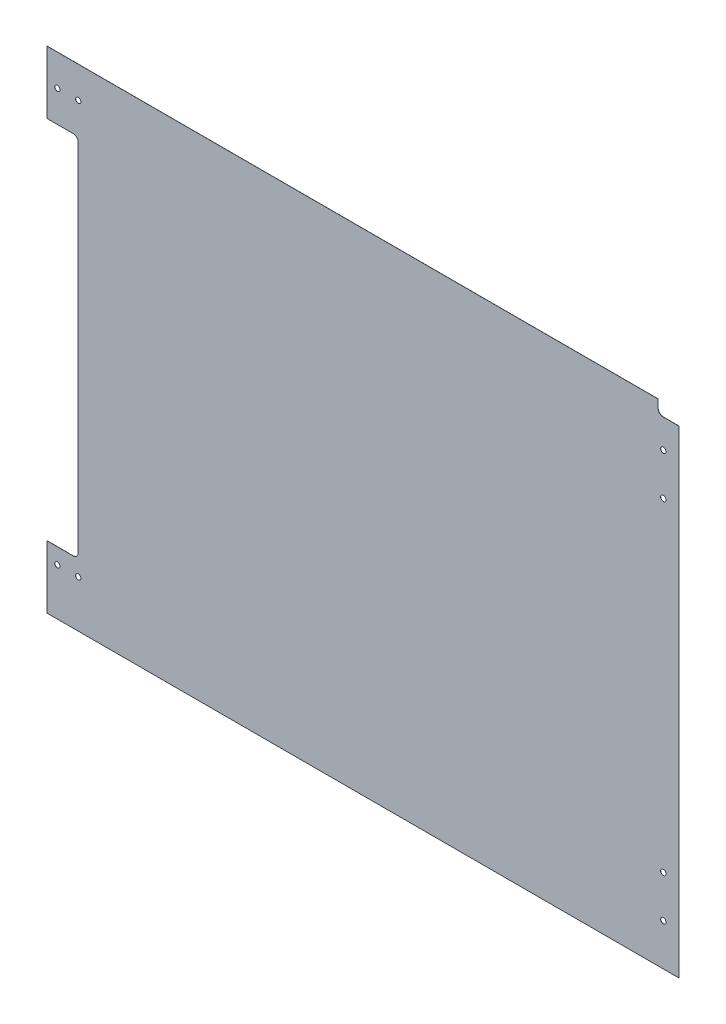
ISO-10303-21;
HEADER;
FILE_DESCRIPTION(('STEP AP214'),'2;1');
FILE_NAME('part.step','',(''),(''),'','','');
FILE_SCHEMA(('AUTOMOTIVE_DESIGN { 1 0 10303 214 1 1 1 1 }'));
ENDSEC;
DATA;
#1=APPLICATION_CONTEXT('core data for automotive mechanical design processes');
#2=APPLICATION_PROTOCOL_DEFINITION('international standard','automotive_design',2000,#1);
#3=PRODUCT_CONTEXT('',#1,'mechanical');
#4=PRODUCT('Part','Part','',(#3));
#5=PRODUCT_RELATED_PRODUCT_CATEGORY('part','',(#4));
#6=PRODUCT_DEFINITION_FORMATION('','',#4);
#7=PRODUCT_DEFINITION_CONTEXT('part definition',#1,'design');
#8=PRODUCT_DEFINITION('design','',#6,#7);
#9=PRODUCT_DEFINITION_SHAPE('','',#8);
#10=(LENGTH_UNIT() NAMED_UNIT(*) SI_UNIT(.MILLI.,.METRE.));
#11=(NAMED_UNIT(*) PLANE_ANGLE_UNIT() SI_UNIT($,.RADIAN.));
#12=(NAMED_UNIT(*) SI_UNIT($,.STERADIAN.) SOLID_ANGLE_UNIT());
#13=UNCERTAINTY_MEASURE_WITH_UNIT(LENGTH_MEASURE(1.E-05),#10,'distance_accuracy_value','');
#14=(GEOMETRIC_REPRESENTATION_CONTEXT(3) GLOBAL_UNCERTAINTY_ASSIGNED_CONTEXT((#13)) GLOBAL_UNIT_ASSIGNED_CONTEXT((#10,
#11,#12)) REPRESENTATION_CONTEXT('',''));
#15=CARTESIAN_POINT('',(0.,0.,0.));
#16=DIRECTION('',(0.,0.,1.));
#17=DIRECTION('',(1.,0.,0.));
#18=AXIS2_PLACEMENT_3D('',#15,#16,#17);
#19=CARTESIAN_POINT('',(0.,0.,0.127000000000002));
#20=DIRECTION('',(0.,0.,-1.));
#21=DIRECTION('',(-1.,0.,0.));
#22=AXIS2_PLACEMENT_3D('',#19,#20,#21);
#23=PLANE('',#22);
#24=CARTESIAN_POINT('',(-387.35,260.35,0.127000000000002));
#25=DIRECTION('',(0.,0.,1.));
#26=DIRECTION('',(1.,0.,0.));
#27=AXIS2_PLACEMENT_3D('',#24,#25,#26);
#28=CIRCLE('',#27,3.17499999999998);
#29=CARTESIAN_POINT('',(-384.175,260.35,0.127000000000002));
#30=VERTEX_POINT('',#29);
#31=EDGE_CURVE('E162',#30,#30,#28,.T.);
#32=ORIENTED_EDGE('',*,*,#31,.F.);
#33=EDGE_LOOP('',(#32));
#34=FACE_BOUND('',#33,.T.);
#35=CARTESIAN_POINT('',(-387.35,-241.3,0.127000000000002));
#36=DIRECTION('',(0.,0.,1.));
#37=DIRECTION('',(1.,0.,0.));
#38=AXIS2_PLACEMENT_3D('',#35,#36,#37);
#39=CIRCLE('',#38,3.17499999999998);
#40=CARTESIAN_POINT('',(-384.175,-241.3,0.127000000000002));
#41=VERTEX_POINT('',#40);
#42=EDGE_CURVE('E182',#41,#41,#39,.T.);
#43=ORIENTED_EDGE('',*,*,#42,.F.);
#44=EDGE_LOOP('',(#43));
#45=FACE_BOUND('',#44,.T.);
#46=CARTESIAN_POINT('',(349.25,247.65,0.127000000000002));
#47=DIRECTION('',(0.,0.,1.));
#48=DIRECTION('',(1.,0.,0.));
#49=AXIS2_PLACEMENT_3D('',#46,#47,#48);
#50=CIRCLE('',#49,3.26389999999999);
#51=CARTESIAN_POINT('',(352.5139,247.65,0.127000000000002));
#52=VERTEX_POINT('',#51);
#53=EDGE_CURVE('E188',#52,#52,#50,.T.);
#54=ORIENTED_EDGE('',*,*,#53,.F.);
#55=EDGE_LOOP('',(#54));
#56=FACE_BOUND('',#55,.T.);
#57=CARTESIAN_POINT('',(349.25,196.85,0.127000000000002));
#58=DIRECTION('',(0.,0.,1.));
#59=DIRECTION('',(1.,0.,0.));
#60=AXIS2_PLACEMENT_3D('',#57,#58,#59);
#61=CIRCLE('',#60,3.26389999999999);
#62=CARTESIAN_POINT('',(352.5139,196.85,0.127000000000002));
#63=VERTEX_POINT('',#62);
#64=EDGE_CURVE('E194',#63,#63,#61,.T.);
#65=ORIENTED_EDGE('',*,*,#64,.F.);
#66=EDGE_LOOP('',(#65));
#67=FACE_BOUND('',#66,.T.);
#68=CARTESIAN_POINT('',(349.25,-196.85,0.127000000000002));
#69=DIRECTION('',(0.,0.,1.));
#70=DIRECTION('',(1.,0.,0.));
#71=AXIS2_PLACEMENT_3D('',#68,#69,#70);
#72=CIRCLE('',#71,3.26389999999999);
#73=CARTESIAN_POINT('',(352.5139,-196.85,0.127000000000002));
#74=VERTEX_POINT('',#73);
#75=EDGE_CURVE('E200',#74,#74,#72,.T.);
#76=ORIENTED_EDGE('',*,*,#75,.F.);
#77=EDGE_LOOP('',(#76));
#78=FACE_BOUND('',#77,.T.);
#79=CARTESIAN_POINT('',(349.25,-247.65,0.127000000000002));
#80=DIRECTION('',(0.,0.,1.));
#81=DIRECTION('',(1.,0.,0.));
#82=AXIS2_PLACEMENT_3D('',#79,#80,#81);
#83=CIRCLE('',#82,3.26389999999999);
#84=CARTESIAN_POINT('',(352.5139,-247.65,0.127000000000002));
#85=VERTEX_POINT('',#84);
#86=EDGE_CURVE('E206',#85,#85,#83,.T.);
#87=ORIENTED_EDGE('',*,*,#86,.F.);
#88=EDGE_LOOP('',(#87));
#89=FACE_BOUND('',#88,.T.);
#90=DIRECTION('',(0.,1.,0.));
#91=VECTOR('',#90,1.);
#92=CARTESIAN_POINT('',(368.3,-298.45,0.127000000000002));
#93=LINE('',#92,#91);
#94=CARTESIAN_POINT('',(368.3,-298.45,0.127000000000002));
#95=VERTEX_POINT('',#94);
#96=CARTESIAN_POINT('',(368.3,282.575,0.127000000000002));
#97=VERTEX_POINT('',#96);
#98=EDGE_CURVE('E252',#95,#97,#93,.T.);
#99=ORIENTED_EDGE('',*,*,#98,.T.);
#100=DIRECTION('',(1.,0.,0.));
#101=VECTOR('',#100,1.);
#102=CARTESIAN_POINT('',(368.3,282.575,0.127000000000002));
#103=LINE('',#102,#101);
#104=CARTESIAN_POINT('',(349.25,282.575,0.127000000000002));
#105=VERTEX_POINT('',#104);
#106=EDGE_CURVE('E151',#105,#97,#103,.T.);
#107=ORIENTED_EDGE('',*,*,#106,.F.);
#108=CARTESIAN_POINT('',(349.25,288.925,0.127000000000002));
#109=DIRECTION('',(0.,0.,1.));
#110=DIRECTION('',(-1.,0.,0.));
#111=AXIS2_PLACEMENT_3D('',#108,#109,#110);
#112=CIRCLE('',#111,6.35000000000002);
#113=CARTESIAN_POINT('',(342.9,288.925,0.127000000000002));
#114=VERTEX_POINT('',#113);
#115=EDGE_CURVE('E153',#114,#105,#112,.T.);
#116=ORIENTED_EDGE('',*,*,#115,.F.);
#117=DIRECTION('',(0.,-1.,0.));
#118=VECTOR('',#117,1.);
#119=CARTESIAN_POINT('',(342.9,298.45,0.127000000000002));
#120=LINE('',#119,#118);
#121=CARTESIAN_POINT('',(342.9,298.45,0.127000000000002));
#122=VERTEX_POINT('',#121);
#123=EDGE_CURVE('E131',#122,#114,#120,.T.);
#124=ORIENTED_EDGE('',*,*,#123,.F.);
#125=DIRECTION('',(-1.,0.,0.));
#126=VECTOR('',#125,1.);
#127=CARTESIAN_POINT('',(-368.3,298.45,0.127000000000002));
#128=LINE('',#127,#126);
#129=CARTESIAN_POINT('',(-400.05,298.45,0.127000000000002));
#130=VERTEX_POINT('',#129);
#131=EDGE_CURVE('E255',#122,#130,#128,.T.);
#132=ORIENTED_EDGE('',*,*,#131,.T.);
#133=DIRECTION('',(0.,-1.,0.));
#134=VECTOR('',#133,1.);
#135=CARTESIAN_POINT('',(-400.05,298.45,0.127000000000002));
#136=LINE('',#135,#134);
#137=CARTESIAN_POINT('',(-400.05,222.25,0.127000000000002));
#138=VERTEX_POINT('',#137);
#139=EDGE_CURVE('E232',#130,#138,#136,.T.);
#140=ORIENTED_EDGE('',*,*,#139,.T.);
#141=DIRECTION('',(1.,0.,0.));
#142=VECTOR('',#141,1.);
#143=CARTESIAN_POINT('',(-368.3,222.25,0.127000000000002));
#144=LINE('',#143,#142);
#145=CARTESIAN_POINT('',(-368.3,222.25,0.127000000000002));
#146=VERTEX_POINT('',#145);
#147=EDGE_CURVE('E235',#138,#146,#144,.T.);
#148=ORIENTED_EDGE('',*,*,#147,.T.);
#149=CARTESIAN_POINT('',(-368.3,215.9,0.127000000000002));
#150=DIRECTION('',(0.,0.,-1.));
#151=DIRECTION('',(-1.,0.,0.));
#152=AXIS2_PLACEMENT_3D('',#149,#150,#151);
#153=CIRCLE('',#152,6.35);
#154=CARTESIAN_POINT('',(-361.95,215.9,0.127000000000002));
#155=VERTEX_POINT('',#154);
#156=EDGE_CURVE('E276',#146,#155,#153,.T.);
#157=ORIENTED_EDGE('',*,*,#156,.T.);
#158=DIRECTION('',(0.,1.,0.));
#159=VECTOR('',#158,1.);
#160=CARTESIAN_POINT('',(-361.95,222.25,0.127000000000002));
#161=LINE('',#160,#159);
#162=CARTESIAN_POINT('',(-361.95,-215.9,0.127000000000002));
#163=VERTEX_POINT('',#162);
#164=EDGE_CURVE('E212',#163,#155,#161,.T.);
#165=ORIENTED_EDGE('',*,*,#164,.F.);
#166=CARTESIAN_POINT('',(-368.3,-215.9,0.127000000000002));
#167=DIRECTION('',(0.,0.,-1.));
#168=DIRECTION('',(-1.,0.,0.));
#169=AXIS2_PLACEMENT_3D('',#166,#167,#168);
#170=CIRCLE('',#169,6.35);
#171=CARTESIAN_POINT('',(-368.3,-222.25,0.127000000000002));
#172=VERTEX_POINT('',#171);
#173=EDGE_CURVE('E42',#163,#172,#170,.T.);
#174=ORIENTED_EDGE('',*,*,#173,.T.);
#175=DIRECTION('',(-1.,0.,0.));
#176=VECTOR('',#175,1.);
#177=CARTESIAN_POINT('',(-368.3,-222.25,0.127000000000002));
#178=LINE('',#177,#176);
#179=CARTESIAN_POINT('',(-400.05,-222.25,0.127000000000002));
#180=VERTEX_POINT('',#179);
#181=EDGE_CURVE('E216',#172,#180,#178,.T.);
#182=ORIENTED_EDGE('',*,*,#181,.T.);
#183=DIRECTION('',(0.,-1.,0.));
#184=VECTOR('',#183,1.);
#185=CARTESIAN_POINT('',(-400.05,-298.45,0.127000000000002));
#186=LINE('',#185,#184);
#187=CARTESIAN_POINT('',(-400.05,-298.45,0.127000000000002));
#188=VERTEX_POINT('',#187);
#189=EDGE_CURVE('E219',#180,#188,#186,.T.);
#190=ORIENTED_EDGE('',*,*,#189,.T.);
#191=DIRECTION('',(1.,0.,0.));
#192=VECTOR('',#191,1.);
#193=CARTESIAN_POINT('',(-368.3,-298.45,0.127000000000002));
#194=LINE('',#193,#192);
#195=EDGE_CURVE('E258',#188,#95,#194,.T.);
#196=ORIENTED_EDGE('',*,*,#195,.T.);
#197=EDGE_LOOP('',(#99,#107,#116,#124,#132,#140,#148,#157,#165,#174,#182,#190,#196));
#198=FACE_BOUND('',#197,.T.);
#199=CARTESIAN_POINT('',(-361.95,-241.3,0.127000000000002));
#200=DIRECTION('',(0.,0.,1.));
#201=DIRECTION('',(1.,0.,0.));
#202=AXIS2_PLACEMENT_3D('',#199,#200,#201);
#203=CIRCLE('',#202,3.17499999999998);
#204=CARTESIAN_POINT('',(-358.775,-241.3,0.127000000000002));
#205=VERTEX_POINT('',#204);
#206=EDGE_CURVE('E176',#205,#205,#203,.T.);
#207=ORIENTED_EDGE('',*,*,#206,.F.);
#208=EDGE_LOOP('',(#207));
#209=FACE_BOUND('',#208,.T.);
#210=CARTESIAN_POINT('',(-361.95,260.35,0.127000000000002));
#211=DIRECTION('',(0.,0.,1.));
#212=DIRECTION('',(1.,0.,0.));
#213=AXIS2_PLACEMENT_3D('',#210,#211,#212);
#214=CIRCLE('',#213,3.17499999999998);
#215=CARTESIAN_POINT('',(-358.775,260.35,0.127000000000002));
#216=VERTEX_POINT('',#215);
#217=EDGE_CURVE('E170',#216,#216,#214,.T.);
#218=ORIENTED_EDGE('',*,*,#217,.F.);
#219=EDGE_LOOP('',(#218));
#220=FACE_BOUND('',#219,.T.);
#221=ADVANCED_FACE('F34',(#34,#45,#56,#67,#78,#89,#198,#209,#220),#23,.F.);
#222=CARTESIAN_POINT('',(0.,0.,0.));
#223=DIRECTION('',(0.,0.,-1.));
#224=DIRECTION('',(-1.,0.,0.));
#225=AXIS2_PLACEMENT_3D('',#222,#223,#224);
#226=PLANE('',#225);
#227=DIRECTION('',(1.,0.,0.));
#228=VECTOR('',#227,1.);
#229=CARTESIAN_POINT('',(368.3,282.575,0.));
#230=LINE('',#229,#228);
#231=CARTESIAN_POINT('',(349.25,282.575,0.));
#232=VERTEX_POINT('',#231);
#233=CARTESIAN_POINT('',(368.3,282.575,0.));
#234=VERTEX_POINT('',#233);
#235=EDGE_CURVE('E144',#232,#234,#230,.T.);
#236=ORIENTED_EDGE('',*,*,#235,.T.);
#237=DIRECTION('',(0.,1.,0.));
#238=VECTOR('',#237,1.);
#239=CARTESIAN_POINT('',(368.3,-298.45,0.));
#240=LINE('',#239,#238);
#241=CARTESIAN_POINT('',(368.3,-298.45,0.));
#242=VERTEX_POINT('',#241);
#243=EDGE_CURVE('E244',#242,#234,#240,.T.);
#244=ORIENTED_EDGE('',*,*,#243,.F.);
#245=DIRECTION('',(1.,0.,0.));
#246=VECTOR('',#245,1.);
#247=CARTESIAN_POINT('',(-368.3,-298.45,0.));
#248=LINE('',#247,#246);
#249=CARTESIAN_POINT('',(-400.05,-298.45,0.));
#250=VERTEX_POINT('',#249);
#251=EDGE_CURVE('E256',#250,#242,#248,.T.);
#252=ORIENTED_EDGE('',*,*,#251,.F.);
#253=DIRECTION('',(0.,-1.,0.));
#254=VECTOR('',#253,1.);
#255=CARTESIAN_POINT('',(-400.05,-298.45,0.));
#256=LINE('',#255,#254);
#257=CARTESIAN_POINT('',(-400.05,-222.25,0.));
#258=VERTEX_POINT('',#257);
#259=EDGE_CURVE('E226',#258,#250,#256,.T.);
#260=ORIENTED_EDGE('',*,*,#259,.F.);
#261=DIRECTION('',(-1.,0.,0.));
#262=VECTOR('',#261,1.);
#263=CARTESIAN_POINT('',(-368.3,-222.25,0.));
#264=LINE('',#263,#262);
#265=CARTESIAN_POINT('',(-368.3,-222.25,0.));
#266=VERTEX_POINT('',#265);
#267=EDGE_CURVE('E222',#266,#258,#264,.T.);
#268=ORIENTED_EDGE('',*,*,#267,.F.);
#269=CARTESIAN_POINT('',(-368.3,-215.9,0.));
#270=DIRECTION('',(0.,0.,-1.));
#271=DIRECTION('',(-1.,0.,0.));
#272=AXIS2_PLACEMENT_3D('',#269,#270,#271);
#273=CIRCLE('',#272,6.35);
#274=CARTESIAN_POINT('',(-361.95,-215.9,0.));
#275=VERTEX_POINT('',#274);
#276=EDGE_CURVE('E11',#266,#275,#273,.F.);
#277=ORIENTED_EDGE('',*,*,#276,.T.);
#278=DIRECTION('',(0.,1.,0.));
#279=VECTOR('',#278,1.);
#280=CARTESIAN_POINT('',(-361.95,222.25,0.));
#281=LINE('',#280,#279);
#282=CARTESIAN_POINT('',(-361.95,215.9,0.));
#283=VERTEX_POINT('',#282);
#284=EDGE_CURVE('E213',#275,#283,#281,.T.);
#285=ORIENTED_EDGE('',*,*,#284,.T.);
#286=CARTESIAN_POINT('',(-368.3,215.9,0.));
#287=DIRECTION('',(0.,0.,-1.));
#288=DIRECTION('',(-1.,0.,0.));
#289=AXIS2_PLACEMENT_3D('',#286,#287,#288);
#290=CIRCLE('',#289,6.35);
#291=CARTESIAN_POINT('',(-368.3,222.25,0.));
#292=VERTEX_POINT('',#291);
#293=EDGE_CURVE('E278',#283,#292,#290,.F.);
#294=ORIENTED_EDGE('',*,*,#293,.T.);
#295=DIRECTION('',(1.,0.,0.));
#296=VECTOR('',#295,1.);
#297=CARTESIAN_POINT('',(-368.3,222.25,0.));
#298=LINE('',#297,#296);
#299=CARTESIAN_POINT('',(-400.05,222.25,0.));
#300=VERTEX_POINT('',#299);
#301=EDGE_CURVE('E241',#300,#292,#298,.T.);
#302=ORIENTED_EDGE('',*,*,#301,.F.);
#303=DIRECTION('',(0.,-1.,0.));
#304=VECTOR('',#303,1.);
#305=CARTESIAN_POINT('',(-400.05,298.45,0.));
#306=LINE('',#305,#304);
#307=CARTESIAN_POINT('',(-400.05,298.45,0.));
#308=VERTEX_POINT('',#307);
#309=EDGE_CURVE('E246',#308,#300,#306,.T.);
#310=ORIENTED_EDGE('',*,*,#309,.F.);
#311=DIRECTION('',(-1.,0.,0.));
#312=VECTOR('',#311,1.);
#313=CARTESIAN_POINT('',(-368.3,298.45,0.));
#314=LINE('',#313,#312);
#315=CARTESIAN_POINT('',(342.9,298.45,0.));
#316=VERTEX_POINT('',#315);
#317=EDGE_CURVE('E150',#316,#308,#314,.T.);
#318=ORIENTED_EDGE('',*,*,#317,.F.);
#319=DIRECTION('',(0.,-1.,0.));
#320=VECTOR('',#319,1.);
#321=CARTESIAN_POINT('',(342.9,298.45,0.));
#322=LINE('',#321,#320);
#323=CARTESIAN_POINT('',(342.9,288.925,0.));
#324=VERTEX_POINT('',#323);
#325=EDGE_CURVE('E49',#316,#324,#322,.T.);
#326=ORIENTED_EDGE('',*,*,#325,.T.);
#327=CARTESIAN_POINT('',(349.25,288.925,0.));
#328=DIRECTION('',(0.,0.,1.));
#329=DIRECTION('',(-1.,0.,0.));
#330=AXIS2_PLACEMENT_3D('',#327,#328,#329);
#331=CIRCLE('',#330,6.35000000000002);
#332=EDGE_CURVE('E139',#324,#232,#331,.T.);
#333=ORIENTED_EDGE('',*,*,#332,.T.);
#334=EDGE_LOOP('',(#236,#244,#252,#260,#268,#277,#285,#294,#302,#310,#318,#326,#333));
#335=FACE_BOUND('',#334,.T.);
#336=CARTESIAN_POINT('',(-387.35,260.35,0.));
#337=DIRECTION('',(0.,0.,-1.));
#338=DIRECTION('',(-1.,0.,0.));
#339=AXIS2_PLACEMENT_3D('',#336,#337,#338);
#340=CIRCLE('',#339,3.17499999999998);
#341=CARTESIAN_POINT('',(-390.525,260.35,0.));
#342=VERTEX_POINT('',#341);
#343=EDGE_CURVE('E167',#342,#342,#340,.F.);
#344=ORIENTED_EDGE('',*,*,#343,.T.);
#345=EDGE_LOOP('',(#344));
#346=FACE_BOUND('',#345,.T.);
#347=CARTESIAN_POINT('',(-361.95,260.35,0.));
#348=DIRECTION('',(0.,0.,-1.));
#349=DIRECTION('',(-1.,0.,0.));
#350=AXIS2_PLACEMENT_3D('',#347,#348,#349);
#351=CIRCLE('',#350,3.17499999999998);
#352=CARTESIAN_POINT('',(-365.125,260.35,0.));
#353=VERTEX_POINT('',#352);
#354=EDGE_CURVE('E173',#353,#353,#351,.F.);
#355=ORIENTED_EDGE('',*,*,#354,.T.);
#356=EDGE_LOOP('',(#355));
#357=FACE_BOUND('',#356,.T.);
#358=CARTESIAN_POINT('',(-361.95,-241.3,0.));
#359=DIRECTION('',(0.,0.,-1.));
#360=DIRECTION('',(-1.,0.,0.));
#361=AXIS2_PLACEMENT_3D('',#358,#359,#360);
#362=CIRCLE('',#361,3.17499999999998);
#363=CARTESIAN_POINT('',(-365.125,-241.3,0.));
#364=VERTEX_POINT('',#363);
#365=EDGE_CURVE('E179',#364,#364,#362,.F.);
#366=ORIENTED_EDGE('',*,*,#365,.T.);
#367=EDGE_LOOP('',(#366));
#368=FACE_BOUND('',#367,.T.);
#369=CARTESIAN_POINT('',(-387.35,-241.3,0.));
#370=DIRECTION('',(0.,0.,-1.));
#371=DIRECTION('',(-1.,0.,0.));
#372=AXIS2_PLACEMENT_3D('',#369,#370,#371);
#373=CIRCLE('',#372,3.17499999999998);
#374=CARTESIAN_POINT('',(-390.525,-241.3,0.));
#375=VERTEX_POINT('',#374);
#376=EDGE_CURVE('E185',#375,#375,#373,.F.);
#377=ORIENTED_EDGE('',*,*,#376,.T.);
#378=EDGE_LOOP('',(#377));
#379=FACE_BOUND('',#378,.T.);
#380=CARTESIAN_POINT('',(349.25,247.65,0.));
#381=DIRECTION('',(0.,0.,1.));
#382=DIRECTION('',(1.,0.,0.));
#383=AXIS2_PLACEMENT_3D('',#380,#381,#382);
#384=CIRCLE('',#383,3.26389999999999);
#385=CARTESIAN_POINT('',(352.5139,247.65,0.));
#386=VERTEX_POINT('',#385);
#387=EDGE_CURVE('E191',#386,#386,#384,.T.);
#388=ORIENTED_EDGE('',*,*,#387,.T.);
#389=EDGE_LOOP('',(#388));
#390=FACE_BOUND('',#389,.T.);
#391=CARTESIAN_POINT('',(349.25,196.85,0.));
#392=DIRECTION('',(0.,0.,1.));
#393=DIRECTION('',(1.,0.,0.));
#394=AXIS2_PLACEMENT_3D('',#391,#392,#393);
#395=CIRCLE('',#394,3.26389999999999);
#396=CARTESIAN_POINT('',(352.5139,196.85,0.));
#397=VERTEX_POINT('',#396);
#398=EDGE_CURVE('E197',#397,#397,#395,.T.);
#399=ORIENTED_EDGE('',*,*,#398,.T.);
#400=EDGE_LOOP('',(#399));
#401=FACE_BOUND('',#400,.T.);
#402=CARTESIAN_POINT('',(349.25,-247.65,0.));
#403=DIRECTION('',(0.,0.,1.));
#404=DIRECTION('',(1.,0.,0.));
#405=AXIS2_PLACEMENT_3D('',#402,#403,#404);
#406=CIRCLE('',#405,3.26389999999999);
#407=CARTESIAN_POINT('',(352.5139,-247.65,0.));
#408=VERTEX_POINT('',#407);
#409=EDGE_CURVE('E209',#408,#408,#406,.T.);
#410=ORIENTED_EDGE('',*,*,#409,.T.);
#411=EDGE_LOOP('',(#410));
#412=FACE_BOUND('',#411,.T.);
#413=CARTESIAN_POINT('',(349.25,-196.85,0.));
#414=DIRECTION('',(0.,0.,1.));
#415=DIRECTION('',(1.,0.,0.));
#416=AXIS2_PLACEMENT_3D('',#413,#414,#415);
#417=CIRCLE('',#416,3.26389999999999);
#418=CARTESIAN_POINT('',(352.5139,-196.85,0.));
#419=VERTEX_POINT('',#418);
#420=EDGE_CURVE('E203',#419,#419,#417,.T.);
#421=ORIENTED_EDGE('',*,*,#420,.T.);
#422=EDGE_LOOP('',(#421));
#423=FACE_BOUND('',#422,.T.);
#424=ADVANCED_FACE('F147',(#335,#346,#357,#368,#379,#390,#401,#412,#423),#226,.T.);
#425=CARTESIAN_POINT('',(368.3,-298.45,0.127000000000002));
#426=DIRECTION('',(-1.,0.,0.));
#427=DIRECTION('',(0.,0.,1.));
#428=AXIS2_PLACEMENT_3D('',#425,#426,#427);
#429=PLANE('',#428);
#430=ORIENTED_EDGE('',*,*,#243,.T.);
#431=DIRECTION('',(0.,0.,1.));
#432=VECTOR('',#431,1.);
#433=CARTESIAN_POINT('',(368.3,282.575,0.));
#434=LINE('',#433,#432);
#435=EDGE_CURVE('E159',#234,#97,#434,.T.);
#436=ORIENTED_EDGE('',*,*,#435,.T.);
#437=ORIENTED_EDGE('',*,*,#98,.F.);
#438=DIRECTION('',(0.,0.,-1.));
#439=VECTOR('',#438,1.);
#440=CARTESIAN_POINT('',(368.3,-298.45,0.127000000000002));
#441=LINE('',#440,#439);
#442=EDGE_CURVE('E260',#95,#242,#441,.T.);
#443=ORIENTED_EDGE('',*,*,#442,.T.);
#444=EDGE_LOOP('',(#430,#436,#437,#443));
#445=FACE_BOUND('',#444,.T.);
#446=ADVANCED_FACE('F313',(#445),#429,.F.);
#447=CARTESIAN_POINT('',(-368.3,298.45,0.127000000000002));
#448=DIRECTION('',(0.,-1.,0.));
#449=DIRECTION('',(0.,0.,-1.));
#450=AXIS2_PLACEMENT_3D('',#447,#448,#449);
#451=PLANE('',#450);
#452=ORIENTED_EDGE('',*,*,#131,.F.);
#453=DIRECTION('',(0.,0.,1.));
#454=VECTOR('',#453,1.);
#455=CARTESIAN_POINT('',(342.9,298.45,0.));
#456=LINE('',#455,#454);
#457=EDGE_CURVE('E136',#316,#122,#456,.T.);
#458=ORIENTED_EDGE('',*,*,#457,.F.);
#459=ORIENTED_EDGE('',*,*,#317,.T.);
#460=DIRECTION('',(0.,0.,1.));
#461=VECTOR('',#460,1.);
#462=CARTESIAN_POINT('',(-400.05,298.45,-82.55));
#463=LINE('',#462,#461);
#464=EDGE_CURVE('E238',#308,#130,#463,.T.);
#465=ORIENTED_EDGE('',*,*,#464,.T.);
#466=EDGE_LOOP('',(#452,#458,#459,#465));
#467=FACE_BOUND('',#466,.T.);
#468=ADVANCED_FACE('F307',(#467),#451,.F.);
#469=CARTESIAN_POINT('',(-368.3,-298.45,0.127000000000002));
#470=DIRECTION('',(0.,1.,0.));
#471=DIRECTION('',(0.,0.,1.));
#472=AXIS2_PLACEMENT_3D('',#469,#470,#471);
#473=PLANE('',#472);
#474=ORIENTED_EDGE('',*,*,#251,.T.);
#475=ORIENTED_EDGE('',*,*,#442,.F.);
#476=ORIENTED_EDGE('',*,*,#195,.F.);
#477=DIRECTION('',(0.,0.,1.));
#478=VECTOR('',#477,1.);
#479=CARTESIAN_POINT('',(-400.05,-298.45,-82.55));
#480=LINE('',#479,#478);
#481=EDGE_CURVE('E229',#250,#188,#480,.T.);
#482=ORIENTED_EDGE('',*,*,#481,.F.);
#483=EDGE_LOOP('',(#474,#475,#476,#482));
#484=FACE_BOUND('',#483,.T.);
#485=ADVANCED_FACE('F318',(#484),#473,.F.);
#486=CARTESIAN_POINT('',(-400.05,298.45,-82.55));
#487=DIRECTION('',(-1.,0.,0.));
#488=DIRECTION('',(0.,-1.,0.));
#489=AXIS2_PLACEMENT_3D('',#486,#487,#488);
#490=PLANE('',#489);
#491=ORIENTED_EDGE('',*,*,#464,.F.);
#492=ORIENTED_EDGE('',*,*,#309,.T.);
#493=DIRECTION('',(0.,0.,1.));
#494=VECTOR('',#493,1.);
#495=CARTESIAN_POINT('',(-400.05,222.25,-82.55));
#496=LINE('',#495,#494);
#497=EDGE_CURVE('E245',#300,#138,#496,.T.);
#498=ORIENTED_EDGE('',*,*,#497,.T.);
#499=ORIENTED_EDGE('',*,*,#139,.F.);
#500=EDGE_LOOP('',(#491,#492,#498,#499));
#501=FACE_BOUND('',#500,.T.);
#502=ADVANCED_FACE('F304',(#501),#490,.T.);
#503=CARTESIAN_POINT('',(-368.3,222.25,-82.55));
#504=DIRECTION('',(0.,-1.,0.));
#505=DIRECTION('',(0.,0.,-1.));
#506=AXIS2_PLACEMENT_3D('',#503,#504,#505);
#507=PLANE('',#506);
#508=ORIENTED_EDGE('',*,*,#301,.T.);
#509=DIRECTION('',(0.,0.,1.));
#510=VECTOR('',#509,1.);
#511=CARTESIAN_POINT('',(-368.3,222.25,-82.55));
#512=LINE('',#511,#510);
#513=EDGE_CURVE('E267',#292,#146,#512,.T.);
#514=ORIENTED_EDGE('',*,*,#513,.T.);
#515=ORIENTED_EDGE('',*,*,#147,.F.);
#516=ORIENTED_EDGE('',*,*,#497,.F.);
#517=EDGE_LOOP('',(#508,#514,#515,#516));
#518=FACE_BOUND('',#517,.T.);
#519=ADVANCED_FACE('F299',(#518),#507,.T.);
#520=CARTESIAN_POINT('',(-368.3,-222.25,-82.55));
#521=DIRECTION('',(0.,1.,0.));
#522=DIRECTION('',(0.,0.,1.));
#523=AXIS2_PLACEMENT_3D('',#520,#521,#522);
#524=PLANE('',#523);
#525=ORIENTED_EDGE('',*,*,#181,.F.);
#526=DIRECTION('',(0.,0.,1.));
#527=VECTOR('',#526,1.);
#528=CARTESIAN_POINT('',(-368.3,-222.25,-82.55));
#529=LINE('',#528,#527);
#530=EDGE_CURVE('E57',#172,#266,#529,.F.);
#531=ORIENTED_EDGE('',*,*,#530,.T.);
#532=ORIENTED_EDGE('',*,*,#267,.T.);
#533=DIRECTION('',(0.,0.,1.));
#534=VECTOR('',#533,1.);
#535=CARTESIAN_POINT('',(-400.05,-222.25,-82.55));
#536=LINE('',#535,#534);
#537=EDGE_CURVE('E225',#258,#180,#536,.T.);
#538=ORIENTED_EDGE('',*,*,#537,.T.);
#539=EDGE_LOOP('',(#525,#531,#532,#538));
#540=FACE_BOUND('',#539,.T.);
#541=ADVANCED_FACE('F284',(#540),#524,.T.);
#542=CARTESIAN_POINT('',(-400.05,-298.45,-82.55));
#543=DIRECTION('',(-1.,0.,0.));
#544=DIRECTION('',(0.,0.,1.));
#545=AXIS2_PLACEMENT_3D('',#542,#543,#544);
#546=PLANE('',#545);
#547=ORIENTED_EDGE('',*,*,#537,.F.);
#548=ORIENTED_EDGE('',*,*,#259,.T.);
#549=ORIENTED_EDGE('',*,*,#481,.T.);
#550=ORIENTED_EDGE('',*,*,#189,.F.);
#551=EDGE_LOOP('',(#547,#548,#549,#550));
#552=FACE_BOUND('',#551,.T.);
#553=ADVANCED_FACE('F320',(#552),#546,.T.);
#554=CARTESIAN_POINT('',(-361.95,222.25,0.));
#555=DIRECTION('',(1.,0.,0.));
#556=DIRECTION('',(0.,1.,0.));
#557=AXIS2_PLACEMENT_3D('',#554,#555,#556);
#558=PLANE('',#557);
#559=ORIENTED_EDGE('',*,*,#164,.T.);
#560=DIRECTION('',(0.,0.,1.));
#561=VECTOR('',#560,1.);
#562=CARTESIAN_POINT('',(-361.95,215.9,0.));
#563=LINE('',#562,#561);
#564=EDGE_CURVE('E273',#155,#283,#563,.F.);
#565=ORIENTED_EDGE('',*,*,#564,.T.);
#566=ORIENTED_EDGE('',*,*,#284,.F.);
#567=DIRECTION('',(0.,0.,1.));
#568=VECTOR('',#567,1.);
#569=CARTESIAN_POINT('',(-361.95,-215.9,0.));
#570=LINE('',#569,#568);
#571=EDGE_CURVE('E270',#275,#163,#570,.T.);
#572=ORIENTED_EDGE('',*,*,#571,.T.);
#573=EDGE_LOOP('',(#559,#565,#566,#572));
#574=FACE_BOUND('',#573,.T.);
#575=ADVANCED_FACE('F292',(#574),#558,.F.);
#576=CARTESIAN_POINT('',(-368.3,215.9,-82.55));
#577=DIRECTION('',(0.,0.,1.));
#578=DIRECTION('',(1.,0.,0.));
#579=AXIS2_PLACEMENT_3D('',#576,#577,#578);
#580=CYLINDRICAL_SURFACE('',#579,6.35);
#581=ORIENTED_EDGE('',*,*,#293,.F.);
#582=ORIENTED_EDGE('',*,*,#564,.F.);
#583=ORIENTED_EDGE('',*,*,#156,.F.);
#584=ORIENTED_EDGE('',*,*,#513,.F.);
#585=EDGE_LOOP('',(#581,#582,#583,#584));
#586=FACE_BOUND('',#585,.T.);
#587=ADVANCED_FACE('F295',(#586),#580,.F.);
#588=CARTESIAN_POINT('',(-368.3,-215.9,0.));
#589=DIRECTION('',(0.,0.,1.));
#590=DIRECTION('',(1.,0.,0.));
#591=AXIS2_PLACEMENT_3D('',#588,#589,#590);
#592=CYLINDRICAL_SURFACE('',#591,6.35);
#593=ORIENTED_EDGE('',*,*,#276,.F.);
#594=ORIENTED_EDGE('',*,*,#530,.F.);
#595=ORIENTED_EDGE('',*,*,#173,.F.);
#596=ORIENTED_EDGE('',*,*,#571,.F.);
#597=EDGE_LOOP('',(#593,#594,#595,#596));
#598=FACE_BOUND('',#597,.T.);
#599=ADVANCED_FACE('F36',(#598),#592,.F.);
#600=CARTESIAN_POINT('',(349.25,-247.65,0.127000000000002));
#601=DIRECTION('',(0.,0.,1.));
#602=DIRECTION('',(1.,0.,0.));
#603=AXIS2_PLACEMENT_3D('',#600,#601,#602);
#604=CYLINDRICAL_SURFACE('',#603,3.26389999999999);
#605=ORIENTED_EDGE('',*,*,#409,.F.);
#606=EDGE_LOOP('',(#605));
#607=FACE_BOUND('',#606,.T.);
#608=ORIENTED_EDGE('',*,*,#86,.T.);
#609=EDGE_LOOP('',(#608));
#610=FACE_BOUND('',#609,.T.);
#611=ADVANCED_FACE('F350',(#607,#610),#604,.F.);
#612=CARTESIAN_POINT('',(349.25,-196.85,0.127000000000002));
#613=DIRECTION('',(0.,0.,1.));
#614=DIRECTION('',(1.,0.,0.));
#615=AXIS2_PLACEMENT_3D('',#612,#613,#614);
#616=CYLINDRICAL_SURFACE('',#615,3.26389999999999);
#617=ORIENTED_EDGE('',*,*,#420,.F.);
#618=EDGE_LOOP('',(#617));
#619=FACE_BOUND('',#618,.T.);
#620=ORIENTED_EDGE('',*,*,#75,.T.);
#621=EDGE_LOOP('',(#620));
#622=FACE_BOUND('',#621,.T.);
#623=ADVANCED_FACE('F354',(#619,#622),#616,.F.);
#624=CARTESIAN_POINT('',(349.25,196.85,0.127000000000002));
#625=DIRECTION('',(0.,0.,1.));
#626=DIRECTION('',(1.,0.,0.));
#627=AXIS2_PLACEMENT_3D('',#624,#625,#626);
#628=CYLINDRICAL_SURFACE('',#627,3.26389999999999);
#629=ORIENTED_EDGE('',*,*,#398,.F.);
#630=EDGE_LOOP('',(#629));
#631=FACE_BOUND('',#630,.T.);
#632=ORIENTED_EDGE('',*,*,#64,.T.);
#633=EDGE_LOOP('',(#632));
#634=FACE_BOUND('',#633,.T.);
#635=ADVANCED_FACE('F360',(#631,#634),#628,.F.);
#636=CARTESIAN_POINT('',(349.25,247.65,0.127000000000002));
#637=DIRECTION('',(0.,0.,1.));
#638=DIRECTION('',(1.,0.,0.));
#639=AXIS2_PLACEMENT_3D('',#636,#637,#638);
#640=CYLINDRICAL_SURFACE('',#639,3.26389999999999);
#641=ORIENTED_EDGE('',*,*,#387,.F.);
#642=EDGE_LOOP('',(#641));
#643=FACE_BOUND('',#642,.T.);
#644=ORIENTED_EDGE('',*,*,#53,.T.);
#645=EDGE_LOOP('',(#644));
#646=FACE_BOUND('',#645,.T.);
#647=ADVANCED_FACE('F368',(#643,#646),#640,.F.);
#648=CARTESIAN_POINT('',(-387.35,-241.3,0.127000000000002));
#649=DIRECTION('',(0.,0.,1.));
#650=DIRECTION('',(1.,0.,0.));
#651=AXIS2_PLACEMENT_3D('',#648,#649,#650);
#652=CYLINDRICAL_SURFACE('',#651,3.17499999999998);
#653=ORIENTED_EDGE('',*,*,#376,.F.);
#654=EDGE_LOOP('',(#653));
#655=FACE_BOUND('',#654,.T.);
#656=ORIENTED_EDGE('',*,*,#42,.T.);
#657=EDGE_LOOP('',(#656));
#658=FACE_BOUND('',#657,.T.);
#659=ADVANCED_FACE('F372',(#655,#658),#652,.F.);
#660=CARTESIAN_POINT('',(-361.95,-241.3,0.127000000000002));
#661=DIRECTION('',(0.,0.,1.));
#662=DIRECTION('',(1.,0.,0.));
#663=AXIS2_PLACEMENT_3D('',#660,#661,#662);
#664=CYLINDRICAL_SURFACE('',#663,3.17499999999998);
#665=ORIENTED_EDGE('',*,*,#365,.F.);
#666=EDGE_LOOP('',(#665));
#667=FACE_BOUND('',#666,.T.);
#668=ORIENTED_EDGE('',*,*,#206,.T.);
#669=EDGE_LOOP('',(#668));
#670=FACE_BOUND('',#669,.T.);
#671=ADVANCED_FACE('F376',(#667,#670),#664,.F.);
#672=CARTESIAN_POINT('',(-361.95,260.35,0.127000000000002));
#673=DIRECTION('',(0.,0.,1.));
#674=DIRECTION('',(1.,0.,0.));
#675=AXIS2_PLACEMENT_3D('',#672,#673,#674);
#676=CYLINDRICAL_SURFACE('',#675,3.17499999999998);
#677=ORIENTED_EDGE('',*,*,#354,.F.);
#678=EDGE_LOOP('',(#677));
#679=FACE_BOUND('',#678,.T.);
#680=ORIENTED_EDGE('',*,*,#217,.T.);
#681=EDGE_LOOP('',(#680));
#682=FACE_BOUND('',#681,.T.);
#683=ADVANCED_FACE('F380',(#679,#682),#676,.F.);
#684=CARTESIAN_POINT('',(-387.35,260.35,0.127000000000002));
#685=DIRECTION('',(0.,0.,1.));
#686=DIRECTION('',(1.,0.,0.));
#687=AXIS2_PLACEMENT_3D('',#684,#685,#686);
#688=CYLINDRICAL_SURFACE('',#687,3.17499999999998);
#689=ORIENTED_EDGE('',*,*,#343,.F.);
#690=EDGE_LOOP('',(#689));
#691=FACE_BOUND('',#690,.T.);
#692=ORIENTED_EDGE('',*,*,#31,.T.);
#693=EDGE_LOOP('',(#692));
#694=FACE_BOUND('',#693,.T.);
#695=ADVANCED_FACE('F384',(#691,#694),#688,.F.);
#696=CARTESIAN_POINT('',(368.3,282.575,0.));
#697=DIRECTION('',(0.,-1.,0.));
#698=DIRECTION('',(0.,0.,-1.));
#699=AXIS2_PLACEMENT_3D('',#696,#697,#698);
#700=PLANE('',#699);
#701=ORIENTED_EDGE('',*,*,#106,.T.);
#702=ORIENTED_EDGE('',*,*,#435,.F.);
#703=ORIENTED_EDGE('',*,*,#235,.F.);
#704=DIRECTION('',(0.,0.,1.));
#705=VECTOR('',#704,1.);
#706=CARTESIAN_POINT('',(349.25,282.575,0.));
#707=LINE('',#706,#705);
#708=EDGE_CURVE('E135',#232,#105,#707,.T.);
#709=ORIENTED_EDGE('',*,*,#708,.T.);
#710=EDGE_LOOP('',(#701,#702,#703,#709));
#711=FACE_BOUND('',#710,.T.);
#712=ADVANCED_FACE('F311',(#711),#700,.F.);
#713=CARTESIAN_POINT('',(349.25,288.925,0.));
#714=DIRECTION('',(0.,0.,1.));
#715=DIRECTION('',(1.,0.,0.));
#716=AXIS2_PLACEMENT_3D('',#713,#714,#715);
#717=CYLINDRICAL_SURFACE('',#716,6.35000000000002);
#718=ORIENTED_EDGE('',*,*,#115,.T.);
#719=ORIENTED_EDGE('',*,*,#708,.F.);
#720=ORIENTED_EDGE('',*,*,#332,.F.);
#721=DIRECTION('',(0.,0.,1.));
#722=VECTOR('',#721,1.);
#723=CARTESIAN_POINT('',(342.9,288.925,0.));
#724=LINE('',#723,#722);
#725=EDGE_CURVE('E127',#324,#114,#724,.T.);
#726=ORIENTED_EDGE('',*,*,#725,.T.);
#727=EDGE_LOOP('',(#718,#719,#720,#726));
#728=FACE_BOUND('',#727,.T.);
#729=ADVANCED_FACE('F140',(#728),#717,.F.);
#730=CARTESIAN_POINT('',(342.9,298.45,0.));
#731=DIRECTION('',(-1.,0.,0.));
#732=DIRECTION('',(0.,0.,1.));
#733=AXIS2_PLACEMENT_3D('',#730,#731,#732);
#734=PLANE('',#733);
#735=ORIENTED_EDGE('',*,*,#123,.T.);
#736=ORIENTED_EDGE('',*,*,#725,.F.);
#737=ORIENTED_EDGE('',*,*,#325,.F.);
#738=ORIENTED_EDGE('',*,*,#457,.T.);
#739=EDGE_LOOP('',(#735,#736,#737,#738));
#740=FACE_BOUND('',#739,.T.);
#741=ADVANCED_FACE('F129',(#740),#734,.F.);
#742=CLOSED_SHELL('',(#221,#424,#446,#468,#485,#502,#519,#541,#553,#575,#587,#599,#611,#623,
#635,#647,#659,#671,#683,#695,#712,#729,#741));
#743=MANIFOLD_SOLID_BREP('B2',#742);
#744=ADVANCED_BREP_SHAPE_REPRESENTATION('',(#18,#743),#14);
#745=SHAPE_DEFINITION_REPRESENTATION(#9,#744);
ENDSEC;
END-ISO-10303-21;
